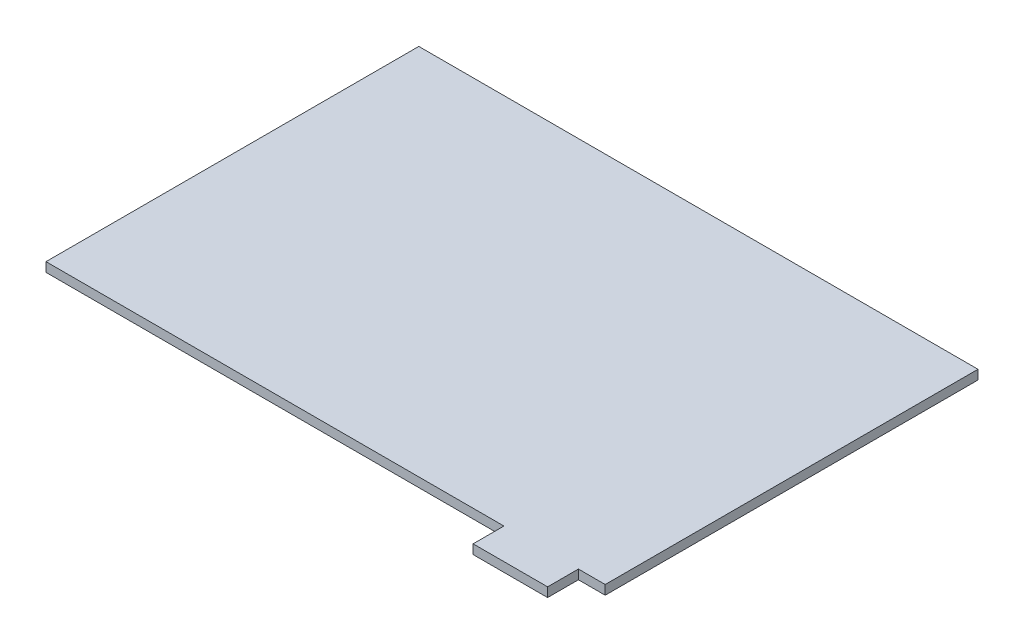
ISO-10303-21;
HEADER;
FILE_DESCRIPTION(('STEP AP214'),'2;1');
FILE_NAME('part.step','',(''),(''),'','','');
FILE_SCHEMA(('AUTOMOTIVE_DESIGN { 1 0 10303 214 1 1 1 1 }'));
ENDSEC;
DATA;
#1=APPLICATION_CONTEXT('core data for automotive mechanical design processes');
#2=APPLICATION_PROTOCOL_DEFINITION('international standard','automotive_design',2000,#1);
#3=PRODUCT_CONTEXT('',#1,'mechanical');
#4=PRODUCT('Part','Part','',(#3));
#5=PRODUCT_RELATED_PRODUCT_CATEGORY('part','',(#4));
#6=PRODUCT_DEFINITION_FORMATION('','',#4);
#7=PRODUCT_DEFINITION_CONTEXT('part definition',#1,'design');
#8=PRODUCT_DEFINITION('design','',#6,#7);
#9=PRODUCT_DEFINITION_SHAPE('','',#8);
#10=(LENGTH_UNIT() NAMED_UNIT(*) SI_UNIT(.MILLI.,.METRE.));
#11=(NAMED_UNIT(*) PLANE_ANGLE_UNIT() SI_UNIT($,.RADIAN.));
#12=(NAMED_UNIT(*) SI_UNIT($,.STERADIAN.) SOLID_ANGLE_UNIT());
#13=UNCERTAINTY_MEASURE_WITH_UNIT(LENGTH_MEASURE(1.E-05),#10,'distance_accuracy_value','');
#14=(GEOMETRIC_REPRESENTATION_CONTEXT(3) GLOBAL_UNCERTAINTY_ASSIGNED_CONTEXT((#13)) GLOBAL_UNIT_ASSIGNED_CONTEXT((#10,
#11,#12)) REPRESENTATION_CONTEXT('',''));
#15=CARTESIAN_POINT('',(0.,0.,0.));
#16=DIRECTION('',(0.,0.,1.));
#17=DIRECTION('',(1.,0.,0.));
#18=AXIS2_PLACEMENT_3D('',#15,#16,#17);
#19=CARTESIAN_POINT('',(76.2,2.54,50.8));
#20=DIRECTION('',(-1.,0.,0.));
#21=DIRECTION('',(0.,0.,1.));
#22=AXIS2_PLACEMENT_3D('',#19,#20,#21);
#23=PLANE('',#22);
#24=DIRECTION('',(0.,0.,-1.));
#25=VECTOR('',#24,1.);
#26=CARTESIAN_POINT('',(76.2,0.,50.8));
#27=LINE('',#26,#25);
#28=CARTESIAN_POINT('',(76.2,0.,50.8));
#29=VERTEX_POINT('',#28);
#30=CARTESIAN_POINT('',(76.2,0.,-50.8));
#31=VERTEX_POINT('',#30);
#32=EDGE_CURVE('E129',#29,#31,#27,.T.);
#33=ORIENTED_EDGE('',*,*,#32,.T.);
#34=DIRECTION('',(0.,-1.,0.));
#35=VECTOR('',#34,1.);
#36=CARTESIAN_POINT('',(76.2,2.54,-50.8));
#37=LINE('',#36,#35);
#38=CARTESIAN_POINT('',(76.2,2.54,-50.8));
#39=VERTEX_POINT('',#38);
#40=EDGE_CURVE('E11',#39,#31,#37,.T.);
#41=ORIENTED_EDGE('',*,*,#40,.F.);
#42=DIRECTION('',(0.,0.,-1.));
#43=VECTOR('',#42,1.);
#44=CARTESIAN_POINT('',(76.2,2.54,50.8));
#45=LINE('',#44,#43);
#46=CARTESIAN_POINT('',(76.2,2.54,50.8));
#47=VERTEX_POINT('',#46);
#48=EDGE_CURVE('E143',#47,#39,#45,.T.);
#49=ORIENTED_EDGE('',*,*,#48,.F.);
#50=DIRECTION('',(0.,-1.,0.));
#51=VECTOR('',#50,1.);
#52=CARTESIAN_POINT('',(76.2,2.54,50.8));
#53=LINE('',#52,#51);
#54=EDGE_CURVE('E125',#47,#29,#53,.T.);
#55=ORIENTED_EDGE('',*,*,#54,.T.);
#56=EDGE_LOOP('',(#33,#41,#49,#55));
#57=FACE_BOUND('',#56,.T.);
#58=ADVANCED_FACE('F33',(#57),#23,.F.);
#59=CARTESIAN_POINT('',(-76.2,2.54,-50.8));
#60=DIRECTION('',(0.,0.,1.));
#61=DIRECTION('',(1.,0.,0.));
#62=AXIS2_PLACEMENT_3D('',#59,#60,#61);
#63=PLANE('',#62);
#64=DIRECTION('',(-1.,0.,0.));
#65=VECTOR('',#64,1.);
#66=CARTESIAN_POINT('',(-76.2,0.,-50.8));
#67=LINE('',#66,#65);
#68=CARTESIAN_POINT('',(-76.2,0.,-50.8));
#69=VERTEX_POINT('',#68);
#70=EDGE_CURVE('E132',#31,#69,#67,.T.);
#71=ORIENTED_EDGE('',*,*,#70,.T.);
#72=DIRECTION('',(0.,-1.,0.));
#73=VECTOR('',#72,1.);
#74=CARTESIAN_POINT('',(-76.2,2.54,-50.8));
#75=LINE('',#74,#73);
#76=CARTESIAN_POINT('',(-76.2,2.54,-50.8));
#77=VERTEX_POINT('',#76);
#78=EDGE_CURVE('E41',#77,#69,#75,.T.);
#79=ORIENTED_EDGE('',*,*,#78,.F.);
#80=DIRECTION('',(-1.,0.,0.));
#81=VECTOR('',#80,1.);
#82=CARTESIAN_POINT('',(-76.2,2.54,-50.8));
#83=LINE('',#82,#81);
#84=EDGE_CURVE('E92',#39,#77,#83,.T.);
#85=ORIENTED_EDGE('',*,*,#84,.F.);
#86=ORIENTED_EDGE('',*,*,#40,.T.);
#87=EDGE_LOOP('',(#71,#79,#85,#86));
#88=FACE_BOUND('',#87,.T.);
#89=ADVANCED_FACE('F178',(#88),#63,.F.);
#90=CARTESIAN_POINT('',(-76.2,2.54,50.8));
#91=DIRECTION('',(1.,0.,0.));
#92=DIRECTION('',(0.,0.,-1.));
#93=AXIS2_PLACEMENT_3D('',#90,#91,#92);
#94=PLANE('',#93);
#95=DIRECTION('',(0.,0.,1.));
#96=VECTOR('',#95,1.);
#97=CARTESIAN_POINT('',(-76.2,0.,50.8));
#98=LINE('',#97,#96);
#99=CARTESIAN_POINT('',(-76.2,0.,50.8));
#100=VERTEX_POINT('',#99);
#101=EDGE_CURVE('E134',#69,#100,#98,.T.);
#102=ORIENTED_EDGE('',*,*,#101,.T.);
#103=DIRECTION('',(0.,-1.,0.));
#104=VECTOR('',#103,1.);
#105=CARTESIAN_POINT('',(-76.2,2.54,50.8));
#106=LINE('',#105,#104);
#107=CARTESIAN_POINT('',(-76.2,2.54,50.8));
#108=VERTEX_POINT('',#107);
#109=EDGE_CURVE('E150',#108,#100,#106,.T.);
#110=ORIENTED_EDGE('',*,*,#109,.F.);
#111=DIRECTION('',(0.,0.,1.));
#112=VECTOR('',#111,1.);
#113=CARTESIAN_POINT('',(-76.2,2.54,50.8));
#114=LINE('',#113,#112);
#115=EDGE_CURVE('E158',#77,#108,#114,.T.);
#116=ORIENTED_EDGE('',*,*,#115,.F.);
#117=ORIENTED_EDGE('',*,*,#78,.T.);
#118=EDGE_LOOP('',(#102,#110,#116,#117));
#119=FACE_BOUND('',#118,.T.);
#120=ADVANCED_FACE('F156',(#119),#94,.F.);
#121=CARTESIAN_POINT('',(-76.2,2.54,50.8));
#122=DIRECTION('',(0.,0.,-1.));
#123=DIRECTION('',(-1.,0.,0.));
#124=AXIS2_PLACEMENT_3D('',#121,#122,#123);
#125=PLANE('',#124);
#126=DIRECTION('',(1.,0.,0.));
#127=VECTOR('',#126,1.);
#128=CARTESIAN_POINT('',(-76.2,0.,50.8));
#129=LINE('',#128,#127);
#130=CARTESIAN_POINT('',(48.6,0.,50.8));
#131=VERTEX_POINT('',#130);
#132=EDGE_CURVE('E136',#100,#131,#129,.T.);
#133=ORIENTED_EDGE('',*,*,#132,.T.);
#134=DIRECTION('',(0.,-1.,0.));
#135=VECTOR('',#134,1.);
#136=CARTESIAN_POINT('',(48.6,2.54,50.8));
#137=LINE('',#136,#135);
#138=CARTESIAN_POINT('',(48.6,2.54,50.8));
#139=VERTEX_POINT('',#138);
#140=EDGE_CURVE('E147',#139,#131,#137,.T.);
#141=ORIENTED_EDGE('',*,*,#140,.F.);
#142=DIRECTION('',(1.,0.,0.));
#143=VECTOR('',#142,1.);
#144=CARTESIAN_POINT('',(-76.2,2.54,50.8));
#145=LINE('',#144,#143);
#146=EDGE_CURVE('E170',#108,#139,#145,.T.);
#147=ORIENTED_EDGE('',*,*,#146,.F.);
#148=ORIENTED_EDGE('',*,*,#109,.T.);
#149=EDGE_LOOP('',(#133,#141,#147,#148));
#150=FACE_BOUND('',#149,.T.);
#151=ADVANCED_FACE('F166',(#150),#125,.F.);
#152=CARTESIAN_POINT('',(48.6,2.54,50.8));
#153=DIRECTION('',(1.,0.,0.));
#154=DIRECTION('',(0.,0.,-1.));
#155=AXIS2_PLACEMENT_3D('',#152,#153,#154);
#156=PLANE('',#155);
#157=DIRECTION('',(0.,0.,1.));
#158=VECTOR('',#157,1.);
#159=CARTESIAN_POINT('',(48.6,0.,50.8));
#160=LINE('',#159,#158);
#161=CARTESIAN_POINT('',(48.6,0.,59.2));
#162=VERTEX_POINT('',#161);
#163=EDGE_CURVE('E138',#131,#162,#160,.T.);
#164=ORIENTED_EDGE('',*,*,#163,.T.);
#165=DIRECTION('',(0.,-1.,0.));
#166=VECTOR('',#165,1.);
#167=CARTESIAN_POINT('',(48.6,2.54,59.2));
#168=LINE('',#167,#166);
#169=CARTESIAN_POINT('',(48.6,2.54,59.2));
#170=VERTEX_POINT('',#169);
#171=EDGE_CURVE('E120',#170,#162,#168,.T.);
#172=ORIENTED_EDGE('',*,*,#171,.F.);
#173=DIRECTION('',(0.,0.,1.));
#174=VECTOR('',#173,1.);
#175=CARTESIAN_POINT('',(48.6,2.54,50.8));
#176=LINE('',#175,#174);
#177=EDGE_CURVE('E111',#139,#170,#176,.T.);
#178=ORIENTED_EDGE('',*,*,#177,.F.);
#179=ORIENTED_EDGE('',*,*,#140,.T.);
#180=EDGE_LOOP('',(#164,#172,#178,#179));
#181=FACE_BOUND('',#180,.T.);
#182=ADVANCED_FACE('F169',(#181),#156,.F.);
#183=CARTESIAN_POINT('',(48.6,2.54,59.2));
#184=DIRECTION('',(0.,0.,-1.));
#185=DIRECTION('',(-1.,0.,0.));
#186=AXIS2_PLACEMENT_3D('',#183,#184,#185);
#187=PLANE('',#186);
#188=DIRECTION('',(1.,0.,0.));
#189=VECTOR('',#188,1.);
#190=CARTESIAN_POINT('',(48.6,0.,59.2));
#191=LINE('',#190,#189);
#192=CARTESIAN_POINT('',(68.9,0.,59.2));
#193=VERTEX_POINT('',#192);
#194=EDGE_CURVE('E119',#162,#193,#191,.T.);
#195=ORIENTED_EDGE('',*,*,#194,.T.);
#196=DIRECTION('',(0.,-1.,0.));
#197=VECTOR('',#196,1.);
#198=CARTESIAN_POINT('',(68.9,2.54,59.2));
#199=LINE('',#198,#197);
#200=CARTESIAN_POINT('',(68.9,2.54,59.2));
#201=VERTEX_POINT('',#200);
#202=EDGE_CURVE('E116',#201,#193,#199,.T.);
#203=ORIENTED_EDGE('',*,*,#202,.F.);
#204=DIRECTION('',(1.,0.,0.));
#205=VECTOR('',#204,1.);
#206=CARTESIAN_POINT('',(48.6,2.54,59.2));
#207=LINE('',#206,#205);
#208=EDGE_CURVE('E105',#170,#201,#207,.T.);
#209=ORIENTED_EDGE('',*,*,#208,.F.);
#210=ORIENTED_EDGE('',*,*,#171,.T.);
#211=EDGE_LOOP('',(#195,#203,#209,#210));
#212=FACE_BOUND('',#211,.T.);
#213=ADVANCED_FACE('F117',(#212),#187,.F.);
#214=CARTESIAN_POINT('',(68.9,2.54,59.2));
#215=DIRECTION('',(-1.,0.,0.));
#216=DIRECTION('',(0.,0.,1.));
#217=AXIS2_PLACEMENT_3D('',#214,#215,#216);
#218=PLANE('',#217);
#219=DIRECTION('',(0.,0.,-1.));
#220=VECTOR('',#219,1.);
#221=CARTESIAN_POINT('',(68.9,0.,59.2));
#222=LINE('',#221,#220);
#223=CARTESIAN_POINT('',(68.9,0.,50.8));
#224=VERTEX_POINT('',#223);
#225=EDGE_CURVE('E78',#193,#224,#222,.T.);
#226=ORIENTED_EDGE('',*,*,#225,.T.);
#227=DIRECTION('',(0.,-1.,0.));
#228=VECTOR('',#227,1.);
#229=CARTESIAN_POINT('',(68.9,2.54,50.8));
#230=LINE('',#229,#228);
#231=CARTESIAN_POINT('',(68.9,2.54,50.8));
#232=VERTEX_POINT('',#231);
#233=EDGE_CURVE('E121',#232,#224,#230,.T.);
#234=ORIENTED_EDGE('',*,*,#233,.F.);
#235=DIRECTION('',(0.,0.,-1.));
#236=VECTOR('',#235,1.);
#237=CARTESIAN_POINT('',(68.9,2.54,59.2));
#238=LINE('',#237,#236);
#239=EDGE_CURVE('E109',#201,#232,#238,.T.);
#240=ORIENTED_EDGE('',*,*,#239,.F.);
#241=ORIENTED_EDGE('',*,*,#202,.T.);
#242=EDGE_LOOP('',(#226,#234,#240,#241));
#243=FACE_BOUND('',#242,.T.);
#244=ADVANCED_FACE('F123',(#243),#218,.F.);
#245=CARTESIAN_POINT('',(68.9,2.54,50.8));
#246=DIRECTION('',(0.,0.,-1.));
#247=DIRECTION('',(-1.,0.,0.));
#248=AXIS2_PLACEMENT_3D('',#245,#246,#247);
#249=PLANE('',#248);
#250=DIRECTION('',(1.,0.,0.));
#251=VECTOR('',#250,1.);
#252=CARTESIAN_POINT('',(68.9,0.,50.8));
#253=LINE('',#252,#251);
#254=EDGE_CURVE('E84',#224,#29,#253,.T.);
#255=ORIENTED_EDGE('',*,*,#254,.T.);
#256=ORIENTED_EDGE('',*,*,#54,.F.);
#257=DIRECTION('',(1.,0.,0.));
#258=VECTOR('',#257,1.);
#259=CARTESIAN_POINT('',(68.9,2.54,50.8));
#260=LINE('',#259,#258);
#261=EDGE_CURVE('E49',#232,#47,#260,.T.);
#262=ORIENTED_EDGE('',*,*,#261,.F.);
#263=ORIENTED_EDGE('',*,*,#233,.T.);
#264=EDGE_LOOP('',(#255,#256,#262,#263));
#265=FACE_BOUND('',#264,.T.);
#266=ADVANCED_FACE('F194',(#265),#249,.F.);
#267=CARTESIAN_POINT('',(0.,2.54,0.));
#268=DIRECTION('',(0.,-1.,0.));
#269=DIRECTION('',(0.,0.,-1.));
#270=AXIS2_PLACEMENT_3D('',#267,#268,#269);
#271=PLANE('',#270);
#272=ORIENTED_EDGE('',*,*,#48,.T.);
#273=ORIENTED_EDGE('',*,*,#84,.T.);
#274=ORIENTED_EDGE('',*,*,#115,.T.);
#275=ORIENTED_EDGE('',*,*,#146,.T.);
#276=ORIENTED_EDGE('',*,*,#177,.T.);
#277=ORIENTED_EDGE('',*,*,#208,.T.);
#278=ORIENTED_EDGE('',*,*,#239,.T.);
#279=ORIENTED_EDGE('',*,*,#261,.T.);
#280=EDGE_LOOP('',(#272,#273,#274,#275,#276,#277,#278,#279));
#281=FACE_BOUND('',#280,.T.);
#282=ADVANCED_FACE('F107',(#281),#271,.F.);
#283=CARTESIAN_POINT('',(0.,0.,0.));
#284=DIRECTION('',(0.,-1.,0.));
#285=DIRECTION('',(0.,0.,-1.));
#286=AXIS2_PLACEMENT_3D('',#283,#284,#285);
#287=PLANE('',#286);
#288=ORIENTED_EDGE('',*,*,#32,.F.);
#289=ORIENTED_EDGE('',*,*,#254,.F.);
#290=ORIENTED_EDGE('',*,*,#225,.F.);
#291=ORIENTED_EDGE('',*,*,#194,.F.);
#292=ORIENTED_EDGE('',*,*,#163,.F.);
#293=ORIENTED_EDGE('',*,*,#132,.F.);
#294=ORIENTED_EDGE('',*,*,#101,.F.);
#295=ORIENTED_EDGE('',*,*,#70,.F.);
#296=EDGE_LOOP('',(#288,#289,#290,#291,#292,#293,#294,#295));
#297=FACE_BOUND('',#296,.T.);
#298=ADVANCED_FACE('F162',(#297),#287,.T.);
#299=CLOSED_SHELL('',(#58,#89,#120,#151,#182,#213,#244,#266,#282,#298));
#300=MANIFOLD_SOLID_BREP('B2',#299);
#301=ADVANCED_BREP_SHAPE_REPRESENTATION('',(#18,#300),#14);
#302=SHAPE_DEFINITION_REPRESENTATION(#9,#301);
ENDSEC;
END-ISO-10303-21;
